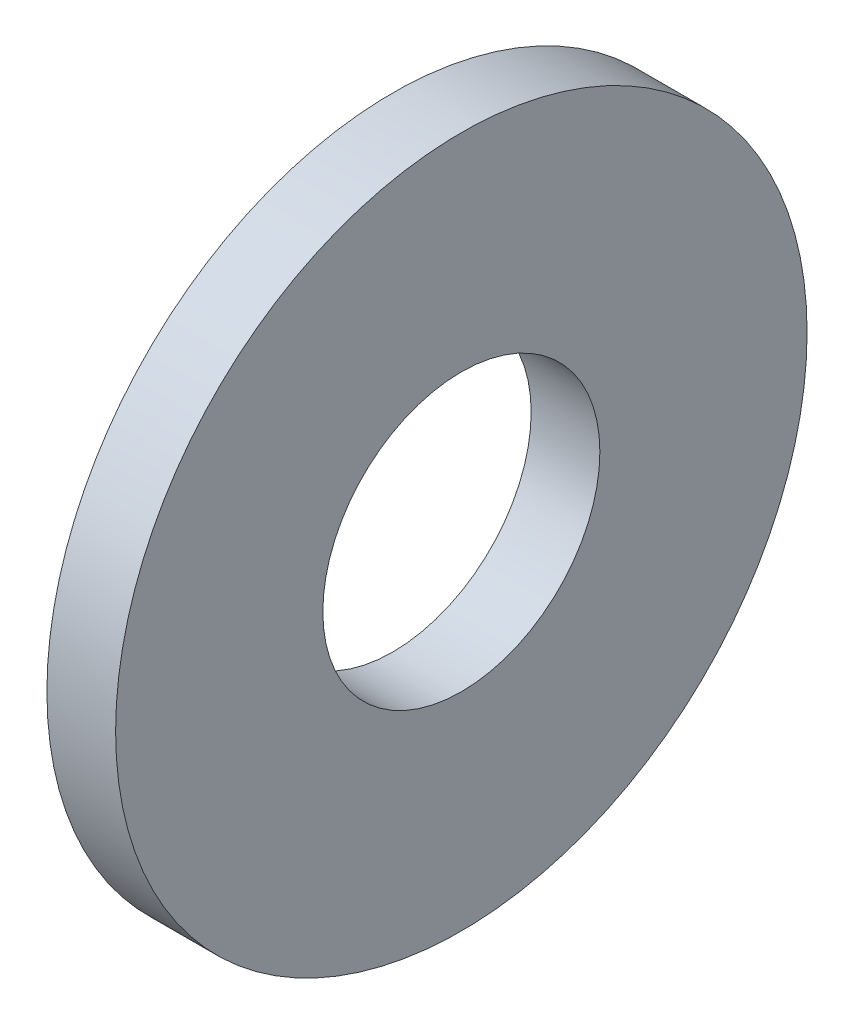
ISO-10303-21;
HEADER;
FILE_DESCRIPTION(('STEP AP214'),'2;1');
FILE_NAME('part.step','',(''),(''),'','','');
FILE_SCHEMA(('AUTOMOTIVE_DESIGN { 1 0 10303 214 1 1 1 1 }'));
ENDSEC;
DATA;
#1=APPLICATION_CONTEXT('core data for automotive mechanical design processes');
#2=APPLICATION_PROTOCOL_DEFINITION('international standard','automotive_design',2000,#1);
#3=PRODUCT_CONTEXT('',#1,'mechanical');
#4=PRODUCT('Part','Part','',(#3));
#5=PRODUCT_RELATED_PRODUCT_CATEGORY('part','',(#4));
#6=PRODUCT_DEFINITION_FORMATION('','',#4);
#7=PRODUCT_DEFINITION_CONTEXT('part definition',#1,'design');
#8=PRODUCT_DEFINITION('design','',#6,#7);
#9=PRODUCT_DEFINITION_SHAPE('','',#8);
#10=(LENGTH_UNIT() NAMED_UNIT(*) SI_UNIT(.MILLI.,.METRE.));
#11=(NAMED_UNIT(*) PLANE_ANGLE_UNIT() SI_UNIT($,.RADIAN.));
#12=(NAMED_UNIT(*) SI_UNIT($,.STERADIAN.) SOLID_ANGLE_UNIT());
#13=UNCERTAINTY_MEASURE_WITH_UNIT(LENGTH_MEASURE(1.E-05),#10,'distance_accuracy_value','');
#14=(GEOMETRIC_REPRESENTATION_CONTEXT(3) GLOBAL_UNCERTAINTY_ASSIGNED_CONTEXT((#13)) GLOBAL_UNIT_ASSIGNED_CONTEXT((#10,
#11,#12)) REPRESENTATION_CONTEXT('',''));
#15=CARTESIAN_POINT('',(0.,0.,0.));
#16=DIRECTION('',(0.,0.,1.));
#17=DIRECTION('',(1.,0.,0.));
#18=AXIS2_PLACEMENT_3D('',#15,#16,#17);
#19=CARTESIAN_POINT('',(-0.3937,0.,0.));
#20=DIRECTION('',(1.,0.,0.));
#21=DIRECTION('',(0.,1.,0.));
#22=AXIS2_PLACEMENT_3D('',#19,#20,#21);
#23=PLANE('',#22);
#24=CARTESIAN_POINT('',(-0.3937,0.,0.));
#25=DIRECTION('',(1.,0.,0.));
#26=DIRECTION('',(0.,0.,-1.));
#27=AXIS2_PLACEMENT_3D('',#24,#25,#26);
#28=CIRCLE('',#27,1.5875);
#29=CARTESIAN_POINT('',(-0.3937,0.,-1.5875));
#30=VERTEX_POINT('',#29);
#31=EDGE_CURVE('E57',#30,#30,#28,.T.);
#32=ORIENTED_EDGE('',*,*,#31,.T.);
#33=EDGE_LOOP('',(#32));
#34=FACE_BOUND('',#33,.T.);
#35=CARTESIAN_POINT('',(-0.3937,0.,0.));
#36=DIRECTION('',(1.,0.,0.));
#37=DIRECTION('',(0.,0.,-1.));
#38=AXIS2_PLACEMENT_3D('',#35,#36,#37);
#39=CIRCLE('',#38,3.9624);
#40=CARTESIAN_POINT('',(-0.3937,0.,-3.9624));
#41=VERTEX_POINT('',#40);
#42=EDGE_CURVE('E64',#41,#41,#39,.T.);
#43=ORIENTED_EDGE('',*,*,#42,.F.);
#44=EDGE_LOOP('',(#43));
#45=FACE_BOUND('',#44,.T.);
#46=ADVANCED_FACE('F16',(#34,#45),#23,.F.);
#47=CARTESIAN_POINT('',(0.3937,0.,0.));
#48=DIRECTION('',(1.,0.,0.));
#49=DIRECTION('',(0.,1.,0.));
#50=AXIS2_PLACEMENT_3D('',#47,#48,#49);
#51=PLANE('',#50);
#52=CARTESIAN_POINT('',(0.3937,0.,0.));
#53=DIRECTION('',(1.,0.,0.));
#54=DIRECTION('',(0.,0.,-1.));
#55=AXIS2_PLACEMENT_3D('',#52,#53,#54);
#56=CIRCLE('',#55,1.5875);
#57=CARTESIAN_POINT('',(0.3937,0.,-1.5875));
#58=VERTEX_POINT('',#57);
#59=EDGE_CURVE('E56',#58,#58,#56,.T.);
#60=ORIENTED_EDGE('',*,*,#59,.F.);
#61=EDGE_LOOP('',(#60));
#62=FACE_BOUND('',#61,.T.);
#63=CARTESIAN_POINT('',(0.3937,0.,0.));
#64=DIRECTION('',(1.,0.,0.));
#65=DIRECTION('',(0.,0.,-1.));
#66=AXIS2_PLACEMENT_3D('',#63,#64,#65);
#67=CIRCLE('',#66,3.9624);
#68=CARTESIAN_POINT('',(0.3937,0.,-3.9624));
#69=VERTEX_POINT('',#68);
#70=EDGE_CURVE('E11',#69,#69,#67,.T.);
#71=ORIENTED_EDGE('',*,*,#70,.T.);
#72=EDGE_LOOP('',(#71));
#73=FACE_BOUND('',#72,.T.);
#74=ADVANCED_FACE('F18',(#62,#73),#51,.T.);
#75=CARTESIAN_POINT('',(0.3937,0.,0.));
#76=DIRECTION('',(-1.,0.,0.));
#77=DIRECTION('',(0.,0.,1.));
#78=AXIS2_PLACEMENT_3D('',#75,#76,#77);
#79=CYLINDRICAL_SURFACE('',#78,3.9624);
#80=ORIENTED_EDGE('',*,*,#42,.T.);
#81=DIRECTION('',(1.,0.,0.));
#82=VECTOR('',#81,1.);
#83=CARTESIAN_POINT('',(0.3937,0.,-3.9624));
#84=LINE('',#83,#82);
#85=EDGE_CURVE('E25',#41,#69,#84,.T.);
#86=ORIENTED_EDGE('',*,*,#85,.T.);
#87=ORIENTED_EDGE('',*,*,#70,.F.);
#88=ORIENTED_EDGE('',*,*,#85,.F.);
#89=EDGE_LOOP('',(#80,#86,#87,#88));
#90=FACE_BOUND('',#89,.T.);
#91=ADVANCED_FACE('F70',(#90),#79,.T.);
#92=CARTESIAN_POINT('',(0.3937,0.,0.));
#93=DIRECTION('',(-1.,0.,0.));
#94=DIRECTION('',(0.,0.,1.));
#95=AXIS2_PLACEMENT_3D('',#92,#93,#94);
#96=CYLINDRICAL_SURFACE('',#95,1.5875);
#97=ORIENTED_EDGE('',*,*,#59,.T.);
#98=DIRECTION('',(-1.,0.,0.));
#99=VECTOR('',#98,1.);
#100=CARTESIAN_POINT('',(0.3937,0.,-1.5875));
#101=LINE('',#100,#99);
#102=EDGE_CURVE('E53',#58,#30,#101,.T.);
#103=ORIENTED_EDGE('',*,*,#102,.T.);
#104=ORIENTED_EDGE('',*,*,#31,.F.);
#105=ORIENTED_EDGE('',*,*,#102,.F.);
#106=EDGE_LOOP('',(#97,#103,#104,#105));
#107=FACE_BOUND('',#106,.T.);
#108=ADVANCED_FACE('F54',(#107),#96,.F.);
#109=CLOSED_SHELL('',(#46,#74,#91,#108));
#110=MANIFOLD_SOLID_BREP('B1',#109);
#111=ADVANCED_BREP_SHAPE_REPRESENTATION('',(#18,#110),#14);
#112=SHAPE_DEFINITION_REPRESENTATION(#9,#111);
ENDSEC;
END-ISO-10303-21;
